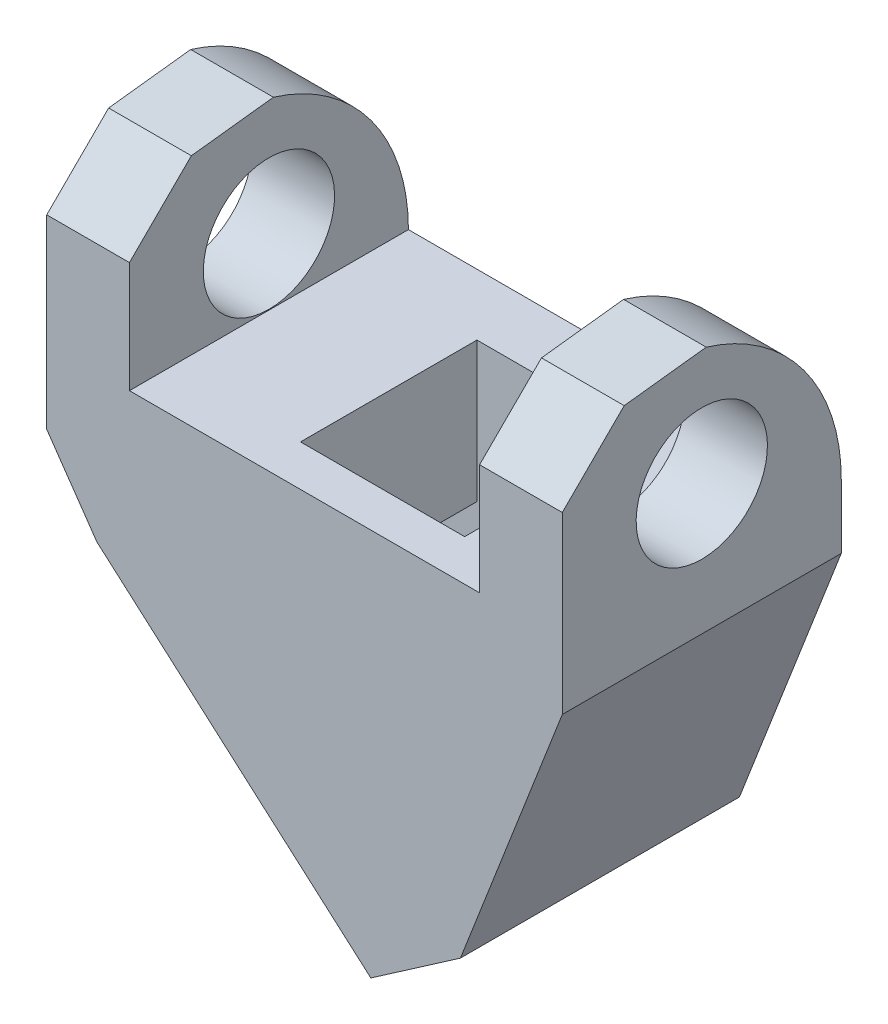
ISO-10303-21;
HEADER;
FILE_DESCRIPTION(('STEP AP214'),'2;1');
FILE_NAME('part.step','',(''),(''),'','','');
FILE_SCHEMA(('AUTOMOTIVE_DESIGN { 1 0 10303 214 1 1 1 1 }'));
ENDSEC;
DATA;
#1=APPLICATION_CONTEXT('core data for automotive mechanical design processes');
#2=APPLICATION_PROTOCOL_DEFINITION('international standard','automotive_design',2000,#1);
#3=PRODUCT_CONTEXT('',#1,'mechanical');
#4=PRODUCT('Part','Part','',(#3));
#5=PRODUCT_RELATED_PRODUCT_CATEGORY('part','',(#4));
#6=PRODUCT_DEFINITION_FORMATION('','',#4);
#7=PRODUCT_DEFINITION_CONTEXT('part definition',#1,'design');
#8=PRODUCT_DEFINITION('design','',#6,#7);
#9=PRODUCT_DEFINITION_SHAPE('','',#8);
#10=(LENGTH_UNIT() NAMED_UNIT(*) SI_UNIT(.MILLI.,.METRE.));
#11=(NAMED_UNIT(*) PLANE_ANGLE_UNIT() SI_UNIT($,.RADIAN.));
#12=(NAMED_UNIT(*) SI_UNIT($,.STERADIAN.) SOLID_ANGLE_UNIT());
#13=UNCERTAINTY_MEASURE_WITH_UNIT(LENGTH_MEASURE(1.E-05),#10,'distance_accuracy_value','');
#14=(GEOMETRIC_REPRESENTATION_CONTEXT(3) GLOBAL_UNCERTAINTY_ASSIGNED_CONTEXT((#13)) GLOBAL_UNIT_ASSIGNED_CONTEXT((#10,
#11,#12)) REPRESENTATION_CONTEXT('',''));
#15=CARTESIAN_POINT('',(0.,0.,0.));
#16=DIRECTION('',(0.,0.,1.));
#17=DIRECTION('',(1.,0.,0.));
#18=AXIS2_PLACEMENT_3D('',#15,#16,#17);
#19=CARTESIAN_POINT('',(-6.62620064692458,-23.6390631964154,17.));
#20=DIRECTION('',(0.660001667960941,0.751264133503508,0.));
#21=DIRECTION('',(-0.751264133503508,0.660001667960941,0.));
#22=AXIS2_PLACEMENT_3D('',#19,#20,#21);
#23=PLANE('',#22);
#24=DIRECTION('',(0.751264133503508,-0.660001667960941,0.));
#25=VECTOR('',#24,1.);
#26=CARTESIAN_POINT('',(-6.62620064692458,-23.6390631964154,0.));
#27=LINE('',#26,#25);
#28=CARTESIAN_POINT('',(-23.3192896933725,-8.97382613432327,0.));
#29=VERTEX_POINT('',#28);
#30=CARTESIAN_POINT('',(-6.62620064692458,-23.6390631964154,0.));
#31=VERTEX_POINT('',#30);
#32=EDGE_CURVE('E294',#29,#31,#27,.T.);
#33=ORIENTED_EDGE('',*,*,#32,.T.);
#34=DIRECTION('',(0.,0.,-1.));
#35=VECTOR('',#34,1.);
#36=CARTESIAN_POINT('',(-6.62620064692458,-23.6390631964154,17.));
#37=LINE('',#36,#35);
#38=CARTESIAN_POINT('',(-6.62620064692458,-23.6390631964154,17.));
#39=VERTEX_POINT('',#38);
#40=EDGE_CURVE('E310',#39,#31,#37,.T.);
#41=ORIENTED_EDGE('',*,*,#40,.F.);
#42=DIRECTION('',(0.751264133503508,-0.660001667960941,0.));
#43=VECTOR('',#42,1.);
#44=CARTESIAN_POINT('',(-6.62620064692458,-23.6390631964154,17.));
#45=LINE('',#44,#43);
#46=CARTESIAN_POINT('',(-23.3192896933725,-8.97382613432327,17.));
#47=VERTEX_POINT('',#46);
#48=EDGE_CURVE('E276',#47,#39,#45,.T.);
#49=ORIENTED_EDGE('',*,*,#48,.F.);
#50=DIRECTION('',(0.,0.,-1.));
#51=VECTOR('',#50,1.);
#52=CARTESIAN_POINT('',(-23.3192896933725,-8.97382613432327,17.));
#53=LINE('',#52,#51);
#54=EDGE_CURVE('E313',#47,#29,#53,.T.);
#55=ORIENTED_EDGE('',*,*,#54,.T.);
#56=EDGE_LOOP('',(#33,#41,#49,#55));
#57=FACE_BOUND('',#56,.T.);
#58=DIRECTION('',(-0.751264133503508,0.660001667960941,0.));
#59=VECTOR('',#58,1.);
#60=CARTESIAN_POINT('',(-19.1687805846796,-12.6201374813718,3.73999999999995));
#61=LINE('',#60,#59);
#62=CARTESIAN_POINT('',(-9.64628246360878,-20.9858564912123,3.73999999999995));
#63=VERTEX_POINT('',#62);
#64=CARTESIAN_POINT('',(-19.0145462083975,-12.7556356917394,3.73999999999995));
#65=VERTEX_POINT('',#64);
#66=EDGE_CURVE('E211',#63,#65,#61,.T.);
#67=ORIENTED_EDGE('',*,*,#66,.T.);
#68=DIRECTION('',(0.,0.,1.));
#69=VECTOR('',#68,1.);
#70=CARTESIAN_POINT('',(-19.0145462083975,-12.7556356917394,3.73999999999995));
#71=LINE('',#70,#69);
#72=CARTESIAN_POINT('',(-19.0145462083975,-12.7556356917394,14.4899999999999));
#73=VERTEX_POINT('',#72);
#74=EDGE_CURVE('E207',#65,#73,#71,.T.);
#75=ORIENTED_EDGE('',*,*,#74,.T.);
#76=DIRECTION('',(0.751264133503508,-0.660001667960941,0.));
#77=VECTOR('',#76,1.);
#78=CARTESIAN_POINT('',(-19.1687805846796,-12.6201374813718,14.4899999999999));
#79=LINE('',#78,#77);
#80=CARTESIAN_POINT('',(-9.64628246360878,-20.9858564912123,14.4899999999999));
#81=VERTEX_POINT('',#80);
#82=EDGE_CURVE('E210',#73,#81,#79,.T.);
#83=ORIENTED_EDGE('',*,*,#82,.T.);
#84=DIRECTION('',(0.,0.,-1.));
#85=VECTOR('',#84,1.);
#86=CARTESIAN_POINT('',(-9.64628246360878,-20.9858564912123,3.73999999999995));
#87=LINE('',#86,#85);
#88=EDGE_CURVE('E213',#81,#63,#87,.T.);
#89=ORIENTED_EDGE('',*,*,#88,.T.);
#90=EDGE_LOOP('',(#67,#75,#83,#89));
#91=FACE_BOUND('',#90,.T.);
#92=ADVANCED_FACE('F32',(#57,#91),#23,.F.);
#93=CARTESIAN_POINT('',(-21.3355501398711,11.1,17.));
#94=DIRECTION('',(-1.,0.,0.));
#95=DIRECTION('',(0.,-1.,0.));
#96=AXIS2_PLACEMENT_3D('',#93,#94,#95);
#97=PLANE('',#96);
#98=CARTESIAN_POINT('',(-21.3355501398711,4.04162085133609,8.5));
#99=DIRECTION('',(-1.,0.,0.));
#100=DIRECTION('',(0.,-1.,0.));
#101=AXIS2_PLACEMENT_3D('',#98,#99,#100);
#102=CIRCLE('',#101,4.);
#103=CARTESIAN_POINT('',(-21.3355501398711,0.0416208513360841,8.5));
#104=VERTEX_POINT('',#103);
#105=EDGE_CURVE('E436',#104,#104,#102,.T.);
#106=ORIENTED_EDGE('',*,*,#105,.T.);
#107=EDGE_LOOP('',(#106));
#108=FACE_BOUND('',#107,.T.);
#109=DIRECTION('',(0.,0.705253158861616,-0.708955557080775));
#110=VECTOR('',#109,1.);
#111=CARTESIAN_POINT('',(-21.3355501398711,8.91863795848581,14.8300297458231));
#112=LINE('',#111,#110);
#113=CARTESIAN_POINT('',(-21.3355501398711,6.76,17.));
#114=VERTEX_POINT('',#113);
#115=CARTESIAN_POINT('',(-21.3355501398711,10.5122475955982,13.2280540668032));
#116=VERTEX_POINT('',#115);
#117=EDGE_CURVE('E256',#114,#116,#112,.T.);
#118=ORIENTED_EDGE('',*,*,#117,.F.);
#119=DIRECTION('',(0.,1.,0.));
#120=VECTOR('',#119,1.);
#121=CARTESIAN_POINT('',(-21.3355501398711,11.1,17.));
#122=LINE('',#121,#120);
#123=CARTESIAN_POINT('',(-21.3355501398711,0.,17.));
#124=VERTEX_POINT('',#123);
#125=EDGE_CURVE('E268',#124,#114,#122,.T.);
#126=ORIENTED_EDGE('',*,*,#125,.F.);
#127=DIRECTION('',(0.,0.,-1.));
#128=VECTOR('',#127,1.);
#129=CARTESIAN_POINT('',(-21.3355501398711,0.,17.));
#130=LINE('',#129,#128);
#131=CARTESIAN_POINT('',(-21.3355501398711,0.,0.));
#132=VERTEX_POINT('',#131);
#133=EDGE_CURVE('E319',#124,#132,#130,.T.);
#134=ORIENTED_EDGE('',*,*,#133,.T.);
#135=CARTESIAN_POINT('',(-21.3355501398711,0.,11.6012165316514));
#136=DIRECTION('',(-1.,0.,0.));
#137=DIRECTION('',(0.,-1.,0.));
#138=AXIS2_PLACEMENT_3D('',#135,#136,#137);
#139=CIRCLE('',#138,11.6012165316514);
#140=CARTESIAN_POINT('',(-21.3355501398711,11.1,8.22805406680315));
#141=VERTEX_POINT('',#140);
#142=EDGE_CURVE('E248',#141,#132,#139,.T.);
#143=ORIENTED_EDGE('',*,*,#142,.F.);
#144=DIRECTION('',(0.,0.116746638974287,-0.993161730177018));
#145=VECTOR('',#144,1.);
#146=CARTESIAN_POINT('',(-21.3355501398711,10.0829078343711,16.8804403268307));
#147=LINE('',#146,#145);
#148=EDGE_CURVE('E262',#116,#141,#147,.T.);
#149=ORIENTED_EDGE('',*,*,#148,.F.);
#150=EDGE_LOOP('',(#118,#126,#134,#143,#149));
#151=FACE_BOUND('',#150,.T.);
#152=ADVANCED_FACE('F357',(#108,#151),#97,.F.);
#153=CARTESIAN_POINT('',(-26.3755501398711,-4.55837914866391,17.));
#154=DIRECTION('',(1.,0.,0.));
#155=DIRECTION('',(0.,0.,-1.));
#156=AXIS2_PLACEMENT_3D('',#153,#154,#155);
#157=PLANE('',#156);
#158=CARTESIAN_POINT('',(-26.3755501398711,4.04162085133609,8.5));
#159=DIRECTION('',(1.,0.,0.));
#160=DIRECTION('',(0.,0.,-1.));
#161=AXIS2_PLACEMENT_3D('',#158,#159,#160);
#162=CIRCLE('',#161,4.);
#163=CARTESIAN_POINT('',(-26.3755501398711,4.04162085133609,4.5));
#164=VERTEX_POINT('',#163);
#165=EDGE_CURVE('E434',#164,#164,#162,.T.);
#166=ORIENTED_EDGE('',*,*,#165,.T.);
#167=EDGE_LOOP('',(#166));
#168=FACE_BOUND('',#167,.T.);
#169=DIRECTION('',(0.,-0.705253158861616,0.708955557080775));
#170=VECTOR('',#169,1.);
#171=CARTESIAN_POINT('',(-26.3755501398711,1.13044173759442,22.6591119995615));
#172=LINE('',#171,#170);
#173=CARTESIAN_POINT('',(-26.3755501398711,10.5122475955982,13.2280540668032));
#174=VERTEX_POINT('',#173);
#175=CARTESIAN_POINT('',(-26.3755501398711,6.76,17.));
#176=VERTEX_POINT('',#175);
#177=EDGE_CURVE('E254',#174,#176,#172,.T.);
#178=ORIENTED_EDGE('',*,*,#177,.F.);
#179=DIRECTION('',(0.,-0.116746638974287,0.993161730177018));
#180=VECTOR('',#179,1.);
#181=CARTESIAN_POINT('',(-26.3755501398711,9.86948760724782,18.6960026752353));
#182=LINE('',#181,#180);
#183=CARTESIAN_POINT('',(-26.3755501398711,11.1,8.22805406680315));
#184=VERTEX_POINT('',#183);
#185=EDGE_CURVE('E260',#184,#174,#182,.T.);
#186=ORIENTED_EDGE('',*,*,#185,.F.);
#187=CARTESIAN_POINT('',(-26.3755501398711,0.,11.6012165316514));
#188=DIRECTION('',(1.,0.,0.));
#189=DIRECTION('',(0.,0.,-1.));
#190=AXIS2_PLACEMENT_3D('',#187,#188,#189);
#191=CIRCLE('',#190,11.6012165316514);
#192=CARTESIAN_POINT('',(-26.3755501398711,0.,0.));
#193=VERTEX_POINT('',#192);
#194=EDGE_CURVE('E246',#193,#184,#191,.T.);
#195=ORIENTED_EDGE('',*,*,#194,.F.);
#196=DIRECTION('',(0.,-1.,0.));
#197=VECTOR('',#196,1.);
#198=CARTESIAN_POINT('',(-26.3755501398711,-4.55837914866391,0.));
#199=LINE('',#198,#197);
#200=CARTESIAN_POINT('',(-26.3755501398711,-4.55837914866391,0.));
#201=VERTEX_POINT('',#200);
#202=EDGE_CURVE('E290',#193,#201,#199,.T.);
#203=ORIENTED_EDGE('',*,*,#202,.T.);
#204=DIRECTION('',(0.,0.,-1.));
#205=VECTOR('',#204,1.);
#206=CARTESIAN_POINT('',(-26.3755501398711,-4.55837914866391,17.));
#207=LINE('',#206,#205);
#208=CARTESIAN_POINT('',(-26.3755501398711,-4.55837914866391,17.));
#209=VERTEX_POINT('',#208);
#210=EDGE_CURVE('E316',#209,#201,#207,.T.);
#211=ORIENTED_EDGE('',*,*,#210,.F.);
#212=DIRECTION('',(0.,-1.,0.));
#213=VECTOR('',#212,1.);
#214=CARTESIAN_POINT('',(-26.3755501398711,-4.55837914866391,17.));
#215=LINE('',#214,#213);
#216=EDGE_CURVE('E272',#176,#209,#215,.T.);
#217=ORIENTED_EDGE('',*,*,#216,.F.);
#218=EDGE_LOOP('',(#178,#186,#195,#203,#211,#217));
#219=FACE_BOUND('',#218,.T.);
#220=ADVANCED_FACE('F393',(#168,#219),#157,.F.);
#221=CARTESIAN_POINT('',(5.04,11.1,17.));
#222=DIRECTION('',(-1.,0.,0.));
#223=DIRECTION('',(0.,-1.,0.));
#224=AXIS2_PLACEMENT_3D('',#221,#222,#223);
#225=PLANE('',#224);
#226=CARTESIAN_POINT('',(5.04,4.04162085133608,8.5));
#227=DIRECTION('',(-1.,0.,0.));
#228=DIRECTION('',(0.,-1.,0.));
#229=AXIS2_PLACEMENT_3D('',#226,#227,#228);
#230=CIRCLE('',#229,4.);
#231=CARTESIAN_POINT('',(5.04,0.0416208513360763,8.5));
#232=VERTEX_POINT('',#231);
#233=EDGE_CURVE('E437',#232,#232,#230,.T.);
#234=ORIENTED_EDGE('',*,*,#233,.T.);
#235=EDGE_LOOP('',(#234));
#236=FACE_BOUND('',#235,.T.);
#237=DIRECTION('',(0.,0.705253158861616,-0.708955557080775));
#238=VECTOR('',#237,1.);
#239=CARTESIAN_POINT('',(5.04,8.91863795848581,14.8300297458231));
#240=LINE('',#239,#238);
#241=CARTESIAN_POINT('',(5.04,6.76,17.));
#242=VERTEX_POINT('',#241);
#243=CARTESIAN_POINT('',(5.04,10.5122475955982,13.2280540668032));
#244=VERTEX_POINT('',#243);
#245=EDGE_CURVE('E252',#242,#244,#240,.T.);
#246=ORIENTED_EDGE('',*,*,#245,.F.);
#247=DIRECTION('',(0.,1.,0.));
#248=VECTOR('',#247,1.);
#249=CARTESIAN_POINT('',(5.04,11.1,17.));
#250=LINE('',#249,#248);
#251=CARTESIAN_POINT('',(5.04,-3.9,17.));
#252=VERTEX_POINT('',#251);
#253=EDGE_CURVE('E282',#252,#242,#250,.T.);
#254=ORIENTED_EDGE('',*,*,#253,.F.);
#255=DIRECTION('',(0.,0.,-1.));
#256=VECTOR('',#255,1.);
#257=CARTESIAN_POINT('',(5.04,-3.9,17.));
#258=LINE('',#257,#256);
#259=CARTESIAN_POINT('',(5.04,-3.9,0.));
#260=VERTEX_POINT('',#259);
#261=EDGE_CURVE('E304',#252,#260,#258,.T.);
#262=ORIENTED_EDGE('',*,*,#261,.T.);
#263=DIRECTION('',(0.,1.,0.));
#264=VECTOR('',#263,1.);
#265=CARTESIAN_POINT('',(5.04,11.1,0.));
#266=LINE('',#265,#264);
#267=CARTESIAN_POINT('',(5.04,0.,0.));
#268=VERTEX_POINT('',#267);
#269=EDGE_CURVE('E269',#260,#268,#266,.T.);
#270=ORIENTED_EDGE('',*,*,#269,.T.);
#271=CARTESIAN_POINT('',(5.04,0.,11.6012165316514));
#272=DIRECTION('',(-1.,0.,0.));
#273=DIRECTION('',(0.,-1.,0.));
#274=AXIS2_PLACEMENT_3D('',#271,#272,#273);
#275=CIRCLE('',#274,11.6012165316514);
#276=CARTESIAN_POINT('',(5.04,11.1,8.22805406680315));
#277=VERTEX_POINT('',#276);
#278=EDGE_CURVE('E244',#277,#268,#275,.T.);
#279=ORIENTED_EDGE('',*,*,#278,.F.);
#280=DIRECTION('',(0.,0.116746638974287,-0.993161730177018));
#281=VECTOR('',#280,1.);
#282=CARTESIAN_POINT('',(5.04,10.0829078343711,16.8804403268307));
#283=LINE('',#282,#281);
#284=EDGE_CURVE('E258',#244,#277,#283,.T.);
#285=ORIENTED_EDGE('',*,*,#284,.F.);
#286=EDGE_LOOP('',(#246,#254,#262,#270,#279,#285));
#287=FACE_BOUND('',#286,.T.);
#288=ADVANCED_FACE('F369',(#236,#287),#225,.F.);
#289=CARTESIAN_POINT('',(0.,0.,17.));
#290=DIRECTION('',(1.,0.,0.));
#291=DIRECTION('',(0.,0.,-1.));
#292=AXIS2_PLACEMENT_3D('',#289,#290,#291);
#293=PLANE('',#292);
#294=CARTESIAN_POINT('',(0.,4.04162085133608,8.5));
#295=DIRECTION('',(1.,0.,0.));
#296=DIRECTION('',(0.,0.,-1.));
#297=AXIS2_PLACEMENT_3D('',#294,#295,#296);
#298=CIRCLE('',#297,4.);
#299=CARTESIAN_POINT('',(0.,4.04162085133608,4.5));
#300=VERTEX_POINT('',#299);
#301=EDGE_CURVE('E36',#300,#300,#298,.T.);
#302=ORIENTED_EDGE('',*,*,#301,.T.);
#303=EDGE_LOOP('',(#302));
#304=FACE_BOUND('',#303,.T.);
#305=DIRECTION('',(0.,-0.705253158861616,0.708955557080775));
#306=VECTOR('',#305,1.);
#307=CARTESIAN_POINT('',(0.,3.39769755775021,20.3799536677963));
#308=LINE('',#307,#306);
#309=CARTESIAN_POINT('',(0.,10.5122475955982,13.2280540668032));
#310=VERTEX_POINT('',#309);
#311=CARTESIAN_POINT('',(0.,6.76,17.));
#312=VERTEX_POINT('',#311);
#313=EDGE_CURVE('E250',#310,#312,#308,.T.);
#314=ORIENTED_EDGE('',*,*,#313,.F.);
#315=DIRECTION('',(0.,-0.116746638974287,0.993161730177018));
#316=VECTOR('',#315,1.);
#317=CARTESIAN_POINT('',(0.,9.93161730177018,18.1674663897429));
#318=LINE('',#317,#316);
#319=CARTESIAN_POINT('',(0.,11.1,8.22805406680315));
#320=VERTEX_POINT('',#319);
#321=EDGE_CURVE('E11',#320,#310,#318,.T.);
#322=ORIENTED_EDGE('',*,*,#321,.F.);
#323=CARTESIAN_POINT('',(0.,0.,11.6012165316514));
#324=DIRECTION('',(1.,0.,0.));
#325=DIRECTION('',(0.,0.,-1.));
#326=AXIS2_PLACEMENT_3D('',#323,#324,#325);
#327=CIRCLE('',#326,11.6012165316514);
#328=CARTESIAN_POINT('',(0.,0.,0.));
#329=VERTEX_POINT('',#328);
#330=EDGE_CURVE('E242',#329,#320,#327,.T.);
#331=ORIENTED_EDGE('',*,*,#330,.F.);
#332=DIRECTION('',(0.,0.,-1.));
#333=VECTOR('',#332,1.);
#334=CARTESIAN_POINT('',(0.,0.,17.));
#335=LINE('',#334,#333);
#336=CARTESIAN_POINT('',(0.,0.,17.));
#337=VERTEX_POINT('',#336);
#338=EDGE_CURVE('E287',#337,#329,#335,.T.);
#339=ORIENTED_EDGE('',*,*,#338,.F.);
#340=DIRECTION('',(0.,-1.,0.));
#341=VECTOR('',#340,1.);
#342=CARTESIAN_POINT('',(0.,0.,17.));
#343=LINE('',#342,#341);
#344=EDGE_CURVE('E285',#312,#337,#343,.T.);
#345=ORIENTED_EDGE('',*,*,#344,.F.);
#346=EDGE_LOOP('',(#314,#322,#331,#339,#345));
#347=FACE_BOUND('',#346,.T.);
#348=ADVANCED_FACE('F344',(#304,#347),#293,.F.);
#349=CARTESIAN_POINT('',(0.,0.,17.));
#350=DIRECTION('',(0.,0.,1.));
#351=DIRECTION('',(1.,0.,0.));
#352=AXIS2_PLACEMENT_3D('',#349,#350,#351);
#353=PLANE('',#352);
#354=ORIENTED_EDGE('',*,*,#253,.T.);
#355=DIRECTION('',(-1.,0.,0.));
#356=VECTOR('',#355,1.);
#357=CARTESIAN_POINT('',(0.,6.76,17.));
#358=LINE('',#357,#356);
#359=EDGE_CURVE('E41',#242,#312,#358,.T.);
#360=ORIENTED_EDGE('',*,*,#359,.T.);
#361=ORIENTED_EDGE('',*,*,#344,.T.);
#362=DIRECTION('',(-1.,0.,0.));
#363=VECTOR('',#362,1.);
#364=CARTESIAN_POINT('',(-21.3355501398711,0.,17.));
#365=LINE('',#364,#363);
#366=EDGE_CURVE('E265',#337,#124,#365,.T.);
#367=ORIENTED_EDGE('',*,*,#366,.T.);
#368=ORIENTED_EDGE('',*,*,#125,.T.);
#369=EDGE_CURVE('E325',#114,#176,#358,.T.);
#370=ORIENTED_EDGE('',*,*,#369,.T.);
#371=ORIENTED_EDGE('',*,*,#216,.T.);
#372=DIRECTION('',(0.569136023556532,-0.822243386528744,0.));
#373=VECTOR('',#372,1.);
#374=CARTESIAN_POINT('',(-23.3192896933725,-8.97382613432327,17.));
#375=LINE('',#374,#373);
#376=EDGE_CURVE('E274',#209,#47,#375,.T.);
#377=ORIENTED_EDGE('',*,*,#376,.T.);
#378=ORIENTED_EDGE('',*,*,#48,.T.);
#379=DIRECTION('',(0.822243386528745,0.569136023556532,0.));
#380=VECTOR('',#379,1.);
#381=CARTESIAN_POINT('',(-1.16650456037372,-19.86,17.));
#382=LINE('',#381,#380);
#383=CARTESIAN_POINT('',(-1.16650456037372,-19.86,17.));
#384=VERTEX_POINT('',#383);
#385=EDGE_CURVE('E278',#39,#384,#382,.T.);
#386=ORIENTED_EDGE('',*,*,#385,.T.);
#387=DIRECTION('',(0.362438038283702,0.932007869282798,0.));
#388=VECTOR('',#387,1.);
#389=CARTESIAN_POINT('',(5.04,-3.9,17.));
#390=LINE('',#389,#388);
#391=EDGE_CURVE('E280',#384,#252,#390,.T.);
#392=ORIENTED_EDGE('',*,*,#391,.T.);
#393=EDGE_LOOP('',(#354,#360,#361,#367,#368,#370,#371,#377,#378,#386,#392));
#394=FACE_BOUND('',#393,.T.);
#395=ADVANCED_FACE('F359',(#394),#353,.T.);
#396=CARTESIAN_POINT('',(0.,0.,0.));
#397=DIRECTION('',(0.,0.,1.));
#398=DIRECTION('',(1.,0.,0.));
#399=AXIS2_PLACEMENT_3D('',#396,#397,#398);
#400=PLANE('',#399);
#401=DIRECTION('',(-1.,0.,0.));
#402=VECTOR('',#401,1.);
#403=CARTESIAN_POINT('',(31.,0.,0.));
#404=LINE('',#403,#402);
#405=EDGE_CURVE('E324',#268,#329,#404,.T.);
#406=ORIENTED_EDGE('',*,*,#405,.F.);
#407=ORIENTED_EDGE('',*,*,#269,.F.);
#408=DIRECTION('',(0.362438038283702,0.932007869282798,0.));
#409=VECTOR('',#408,1.);
#410=CARTESIAN_POINT('',(5.04,-3.9,0.));
#411=LINE('',#410,#409);
#412=CARTESIAN_POINT('',(-1.16650456037372,-19.86,0.));
#413=VERTEX_POINT('',#412);
#414=EDGE_CURVE('E298',#413,#260,#411,.T.);
#415=ORIENTED_EDGE('',*,*,#414,.F.);
#416=DIRECTION('',(0.822243386528745,0.569136023556532,0.));
#417=VECTOR('',#416,1.);
#418=CARTESIAN_POINT('',(-1.16650456037372,-19.86,0.));
#419=LINE('',#418,#417);
#420=EDGE_CURVE('E296',#31,#413,#419,.T.);
#421=ORIENTED_EDGE('',*,*,#420,.F.);
#422=ORIENTED_EDGE('',*,*,#32,.F.);
#423=DIRECTION('',(0.569136023556532,-0.822243386528744,0.));
#424=VECTOR('',#423,1.);
#425=CARTESIAN_POINT('',(-23.3192896933725,-8.97382613432327,0.));
#426=LINE('',#425,#424);
#427=EDGE_CURVE('E292',#201,#29,#426,.T.);
#428=ORIENTED_EDGE('',*,*,#427,.F.);
#429=ORIENTED_EDGE('',*,*,#202,.F.);
#430=EDGE_CURVE('E322',#132,#193,#404,.T.);
#431=ORIENTED_EDGE('',*,*,#430,.F.);
#432=DIRECTION('',(-1.,0.,0.));
#433=VECTOR('',#432,1.);
#434=CARTESIAN_POINT('',(-21.3355501398711,0.,0.));
#435=LINE('',#434,#433);
#436=EDGE_CURVE('E264',#329,#132,#435,.T.);
#437=ORIENTED_EDGE('',*,*,#436,.F.);
#438=EDGE_LOOP('',(#406,#407,#415,#421,#422,#428,#429,#431,#437));
#439=FACE_BOUND('',#438,.T.);
#440=ADVANCED_FACE('F349',(#439),#400,.F.);
#441=CARTESIAN_POINT('',(-21.3355501398711,0.,17.));
#442=DIRECTION('',(0.,-1.,0.));
#443=DIRECTION('',(0.,0.,-1.));
#444=AXIS2_PLACEMENT_3D('',#441,#442,#443);
#445=PLANE('',#444);
#446=DIRECTION('',(-1.,0.,0.));
#447=VECTOR('',#446,1.);
#448=CARTESIAN_POINT('',(-3.42,0.,3.74));
#449=LINE('',#448,#447);
#450=CARTESIAN_POINT('',(-3.42,0.,3.74));
#451=VERTEX_POINT('',#450);
#452=CARTESIAN_POINT('',(-13.42,0.,3.74));
#453=VERTEX_POINT('',#452);
#454=EDGE_CURVE('E186',#451,#453,#449,.T.);
#455=ORIENTED_EDGE('',*,*,#454,.F.);
#456=DIRECTION('',(0.,0.,-1.));
#457=VECTOR('',#456,1.);
#458=CARTESIAN_POINT('',(-3.42,0.,14.49));
#459=LINE('',#458,#457);
#460=CARTESIAN_POINT('',(-3.42,0.,14.49));
#461=VERTEX_POINT('',#460);
#462=EDGE_CURVE('E48',#461,#451,#459,.T.);
#463=ORIENTED_EDGE('',*,*,#462,.F.);
#464=DIRECTION('',(1.,0.,0.));
#465=VECTOR('',#464,1.);
#466=CARTESIAN_POINT('',(-3.42,0.,14.49));
#467=LINE('',#466,#465);
#468=CARTESIAN_POINT('',(-13.42,0.,14.49));
#469=VERTEX_POINT('',#468);
#470=EDGE_CURVE('E193',#469,#461,#467,.T.);
#471=ORIENTED_EDGE('',*,*,#470,.F.);
#472=DIRECTION('',(0.,0.,1.));
#473=VECTOR('',#472,1.);
#474=CARTESIAN_POINT('',(-13.42,0.,14.49));
#475=LINE('',#474,#473);
#476=EDGE_CURVE('E177',#453,#469,#475,.T.);
#477=ORIENTED_EDGE('',*,*,#476,.F.);
#478=EDGE_LOOP('',(#455,#463,#471,#477));
#479=FACE_BOUND('',#478,.T.);
#480=ORIENTED_EDGE('',*,*,#436,.T.);
#481=ORIENTED_EDGE('',*,*,#133,.F.);
#482=ORIENTED_EDGE('',*,*,#366,.F.);
#483=ORIENTED_EDGE('',*,*,#338,.T.);
#484=EDGE_LOOP('',(#480,#481,#482,#483));
#485=FACE_BOUND('',#484,.T.);
#486=ADVANCED_FACE('F34',(#479,#485),#445,.F.);
#487=CARTESIAN_POINT('',(-23.3192896933725,-8.97382613432327,17.));
#488=DIRECTION('',(0.822243386528744,0.569136023556532,0.));
#489=DIRECTION('',(-0.569136023556532,0.822243386528744,0.));
#490=AXIS2_PLACEMENT_3D('',#487,#488,#489);
#491=PLANE('',#490);
#492=ORIENTED_EDGE('',*,*,#427,.T.);
#493=ORIENTED_EDGE('',*,*,#54,.F.);
#494=ORIENTED_EDGE('',*,*,#376,.F.);
#495=ORIENTED_EDGE('',*,*,#210,.T.);
#496=EDGE_LOOP('',(#492,#493,#494,#495));
#497=FACE_BOUND('',#496,.T.);
#498=ADVANCED_FACE('F388',(#497),#491,.F.);
#499=CARTESIAN_POINT('',(-1.16650456037372,-19.86,17.));
#500=DIRECTION('',(-0.569136023556532,0.822243386528745,0.));
#501=DIRECTION('',(-0.822243386528745,-0.569136023556532,0.));
#502=AXIS2_PLACEMENT_3D('',#499,#500,#501);
#503=PLANE('',#502);
#504=ORIENTED_EDGE('',*,*,#420,.T.);
#505=DIRECTION('',(0.,0.,-1.));
#506=VECTOR('',#505,1.);
#507=CARTESIAN_POINT('',(-1.16650456037372,-19.86,17.));
#508=LINE('',#507,#506);
#509=EDGE_CURVE('E307',#384,#413,#508,.T.);
#510=ORIENTED_EDGE('',*,*,#509,.F.);
#511=ORIENTED_EDGE('',*,*,#385,.F.);
#512=ORIENTED_EDGE('',*,*,#40,.T.);
#513=EDGE_LOOP('',(#504,#510,#511,#512));
#514=FACE_BOUND('',#513,.T.);
#515=ADVANCED_FACE('F381',(#514),#503,.F.);
#516=CARTESIAN_POINT('',(5.04,-3.9,17.));
#517=DIRECTION('',(-0.932007869282799,0.362438038283702,0.));
#518=DIRECTION('',(-0.362438038283702,-0.932007869282798,0.));
#519=AXIS2_PLACEMENT_3D('',#516,#517,#518);
#520=PLANE('',#519);
#521=ORIENTED_EDGE('',*,*,#414,.T.);
#522=ORIENTED_EDGE('',*,*,#261,.F.);
#523=ORIENTED_EDGE('',*,*,#391,.F.);
#524=ORIENTED_EDGE('',*,*,#509,.T.);
#525=EDGE_LOOP('',(#521,#522,#523,#524));
#526=FACE_BOUND('',#525,.T.);
#527=ADVANCED_FACE('F376',(#526),#520,.F.);
#528=CARTESIAN_POINT('',(31.,0.,11.6012165316514));
#529=DIRECTION('',(-1.,0.,0.));
#530=DIRECTION('',(0.,-1.,0.));
#531=AXIS2_PLACEMENT_3D('',#528,#529,#530);
#532=CYLINDRICAL_SURFACE('',#531,11.6012165316514);
#533=ORIENTED_EDGE('',*,*,#142,.T.);
#534=ORIENTED_EDGE('',*,*,#430,.T.);
#535=ORIENTED_EDGE('',*,*,#194,.T.);
#536=DIRECTION('',(-1.,0.,0.));
#537=VECTOR('',#536,1.);
#538=CARTESIAN_POINT('',(31.,11.1,8.22805406680315));
#539=LINE('',#538,#537);
#540=EDGE_CURVE('E216',#141,#184,#539,.T.);
#541=ORIENTED_EDGE('',*,*,#540,.F.);
#542=EDGE_LOOP('',(#533,#534,#535,#541));
#543=FACE_BOUND('',#542,.T.);
#544=ADVANCED_FACE('F396',(#543),#532,.T.);
#545=CARTESIAN_POINT('',(31.,11.8975810418533,11.8354479752292));
#546=DIRECTION('',(0.,0.708955557080775,0.705253158861616));
#547=DIRECTION('',(0.,-0.705253158861616,0.708955557080775));
#548=AXIS2_PLACEMENT_3D('',#545,#546,#547);
#549=PLANE('',#548);
#550=ORIENTED_EDGE('',*,*,#117,.T.);
#551=DIRECTION('',(-1.,0.,0.));
#552=VECTOR('',#551,1.);
#553=CARTESIAN_POINT('',(31.,10.5122475955982,13.2280540668032));
#554=LINE('',#553,#552);
#555=EDGE_CURVE('E235',#116,#174,#554,.T.);
#556=ORIENTED_EDGE('',*,*,#555,.T.);
#557=ORIENTED_EDGE('',*,*,#177,.T.);
#558=ORIENTED_EDGE('',*,*,#369,.F.);
#559=EDGE_LOOP('',(#550,#556,#557,#558));
#560=FACE_BOUND('',#559,.T.);
#561=ADVANCED_FACE('F401',(#560),#549,.T.);
#562=CARTESIAN_POINT('',(31.,11.9027382990231,1.39917261084334));
#563=DIRECTION('',(0.,0.993161730177018,0.116746638974287));
#564=DIRECTION('',(0.,-0.116746638974287,0.993161730177018));
#565=AXIS2_PLACEMENT_3D('',#562,#563,#564);
#566=PLANE('',#565);
#567=ORIENTED_EDGE('',*,*,#148,.T.);
#568=ORIENTED_EDGE('',*,*,#540,.T.);
#569=ORIENTED_EDGE('',*,*,#185,.T.);
#570=ORIENTED_EDGE('',*,*,#555,.F.);
#571=EDGE_LOOP('',(#567,#568,#569,#570));
#572=FACE_BOUND('',#571,.T.);
#573=ADVANCED_FACE('F398',(#572),#566,.T.);
#574=ORIENTED_EDGE('',*,*,#284,.T.);
#575=EDGE_CURVE('E239',#277,#320,#539,.T.);
#576=ORIENTED_EDGE('',*,*,#575,.T.);
#577=ORIENTED_EDGE('',*,*,#321,.T.);
#578=EDGE_CURVE('E238',#244,#310,#554,.T.);
#579=ORIENTED_EDGE('',*,*,#578,.F.);
#580=EDGE_LOOP('',(#574,#576,#577,#579));
#581=FACE_BOUND('',#580,.T.);
#582=ADVANCED_FACE('F367',(#581),#566,.T.);
#583=ORIENTED_EDGE('',*,*,#245,.T.);
#584=ORIENTED_EDGE('',*,*,#578,.T.);
#585=ORIENTED_EDGE('',*,*,#313,.T.);
#586=ORIENTED_EDGE('',*,*,#359,.F.);
#587=EDGE_LOOP('',(#583,#584,#585,#586));
#588=FACE_BOUND('',#587,.T.);
#589=ADVANCED_FACE('F362',(#588),#549,.T.);
#590=ORIENTED_EDGE('',*,*,#278,.T.);
#591=ORIENTED_EDGE('',*,*,#405,.T.);
#592=ORIENTED_EDGE('',*,*,#330,.T.);
#593=ORIENTED_EDGE('',*,*,#575,.F.);
#594=EDGE_LOOP('',(#590,#591,#592,#593));
#595=FACE_BOUND('',#594,.T.);
#596=ADVANCED_FACE('F333',(#595),#532,.T.);
#597=CARTESIAN_POINT('',(-7.30160744156,-11.1019561027789,0.));
#598=DIRECTION('',(0.660001667960941,0.751264133503508,0.));
#599=DIRECTION('',(-0.751264133503507,0.660001667960941,0.));
#600=AXIS2_PLACEMENT_3D('',#597,#598,#599);
#601=PLANE('',#600);
#602=DIRECTION('',(-0.751264133503507,0.660001667960941,0.));
#603=VECTOR('',#602,1.);
#604=CARTESIAN_POINT('',(-11.7086774203584,-7.23025052399265,14.4899999999999));
#605=LINE('',#604,#603);
#606=CARTESIAN_POINT('',(-2.3404136755697,-15.4604713234656,14.4899999999999));
#607=VERTEX_POINT('',#606);
#608=CARTESIAN_POINT('',(-3.42,-14.5120315629928,14.49));
#609=VERTEX_POINT('',#608);
#610=EDGE_CURVE('E220',#607,#609,#605,.T.);
#611=ORIENTED_EDGE('',*,*,#610,.T.);
#612=DIRECTION('',(0.,0.,-1.));
#613=VECTOR('',#612,1.);
#614=CARTESIAN_POINT('',(-3.42,-14.5120315629928,0.));
#615=LINE('',#614,#613);
#616=CARTESIAN_POINT('',(-3.42,-14.5120315629928,3.74));
#617=VERTEX_POINT('',#616);
#618=EDGE_CURVE('E200',#609,#617,#615,.T.);
#619=ORIENTED_EDGE('',*,*,#618,.T.);
#620=DIRECTION('',(0.751264133503507,-0.660001667960941,0.));
#621=VECTOR('',#620,1.);
#622=CARTESIAN_POINT('',(-11.7086774203584,-7.23025052399265,3.73999999999995));
#623=LINE('',#622,#621);
#624=CARTESIAN_POINT('',(-2.3404136755697,-15.4604713234656,3.73999999999995));
#625=VERTEX_POINT('',#624);
#626=EDGE_CURVE('E228',#617,#625,#623,.T.);
#627=ORIENTED_EDGE('',*,*,#626,.T.);
#628=DIRECTION('',(0.,0.,1.));
#629=VECTOR('',#628,1.);
#630=CARTESIAN_POINT('',(-2.34041367556969,-15.4604713234656,3.73999999999995));
#631=LINE('',#630,#629);
#632=EDGE_CURVE('E217',#625,#607,#631,.T.);
#633=ORIENTED_EDGE('',*,*,#632,.T.);
#634=EDGE_LOOP('',(#611,#619,#627,#633));
#635=FACE_BOUND('',#634,.T.);
#636=ADVANCED_FACE('F475',(#635),#601,.F.);
#637=CARTESIAN_POINT('',(-19.8288763947251,-13.3715087745614,3.73999999999995));
#638=DIRECTION('',(0.,0.,1.));
#639=DIRECTION('',(0.,-1.,0.));
#640=AXIS2_PLACEMENT_3D('',#637,#638,#639);
#641=PLANE('',#640);
#642=ORIENTED_EDGE('',*,*,#626,.F.);
#643=DIRECTION('',(0.,1.,0.));
#644=VECTOR('',#643,1.);
#645=CARTESIAN_POINT('',(-3.42,-36.6035261952487,3.74));
#646=LINE('',#645,#644);
#647=EDGE_CURVE('E183',#617,#451,#646,.T.);
#648=ORIENTED_EDGE('',*,*,#647,.T.);
#649=ORIENTED_EDGE('',*,*,#454,.T.);
#650=DIRECTION('',(0.,1.,0.));
#651=VECTOR('',#650,1.);
#652=CARTESIAN_POINT('',(-13.42,-36.6035261952487,3.74));
#653=LINE('',#652,#651);
#654=CARTESIAN_POINT('',(-13.42,-8.5245136257694,3.73999999999995));
#655=VERTEX_POINT('',#654);
#656=EDGE_CURVE('E56',#655,#453,#653,.T.);
#657=ORIENTED_EDGE('',*,*,#656,.F.);
#658=DIRECTION('',(0.79758392882523,0.603207987745281,0.));
#659=VECTOR('',#658,1.);
#660=CARTESIAN_POINT('',(-19.8288763947251,-13.3715087745614,3.73999999999995));
#661=LINE('',#660,#659);
#662=EDGE_CURVE('E221',#65,#655,#661,.T.);
#663=ORIENTED_EDGE('',*,*,#662,.F.);
#664=ORIENTED_EDGE('',*,*,#66,.F.);
#665=DIRECTION('',(0.79758392882523,0.603207987745281,0.));
#666=VECTOR('',#665,1.);
#667=CARTESIAN_POINT('',(-10.4606126499363,-21.6017295740343,3.73999999999995));
#668=LINE('',#667,#666);
#669=EDGE_CURVE('E206',#63,#625,#668,.T.);
#670=ORIENTED_EDGE('',*,*,#669,.T.);
#671=EDGE_LOOP('',(#642,#648,#649,#657,#663,#664,#670));
#672=FACE_BOUND('',#671,.T.);
#673=ADVANCED_FACE('F188',(#672),#641,.T.);
#674=CARTESIAN_POINT('',(-19.8288763947251,-13.3715087745614,3.73999999999995));
#675=DIRECTION('',(0.603207987745281,-0.79758392882523,0.));
#676=DIRECTION('',(0.79758392882523,0.603207987745281,0.));
#677=AXIS2_PLACEMENT_3D('',#674,#675,#676);
#678=PLANE('',#677);
#679=DIRECTION('',(0.,0.,-1.));
#680=VECTOR('',#679,1.);
#681=CARTESIAN_POINT('',(-13.42,-8.5245136257694,3.73999999999994));
#682=LINE('',#681,#680);
#683=CARTESIAN_POINT('',(-13.42,-8.5245136257694,14.49));
#684=VERTEX_POINT('',#683);
#685=EDGE_CURVE('E180',#684,#655,#682,.T.);
#686=ORIENTED_EDGE('',*,*,#685,.F.);
#687=DIRECTION('',(0.79758392882523,0.603207987745281,0.));
#688=VECTOR('',#687,1.);
#689=CARTESIAN_POINT('',(-19.8288763947251,-13.3715087745614,14.4899999999999));
#690=LINE('',#689,#688);
#691=EDGE_CURVE('E224',#73,#684,#690,.T.);
#692=ORIENTED_EDGE('',*,*,#691,.F.);
#693=ORIENTED_EDGE('',*,*,#74,.F.);
#694=ORIENTED_EDGE('',*,*,#662,.T.);
#695=EDGE_LOOP('',(#686,#692,#693,#694));
#696=FACE_BOUND('',#695,.T.);
#697=ADVANCED_FACE('F469',(#696),#678,.T.);
#698=CARTESIAN_POINT('',(-19.8288763947251,-13.3715087745614,14.4899999999999));
#699=DIRECTION('',(0.,0.,-1.));
#700=DIRECTION('',(-1.,0.,0.));
#701=AXIS2_PLACEMENT_3D('',#698,#699,#700);
#702=PLANE('',#701);
#703=DIRECTION('',(0.,1.,0.));
#704=VECTOR('',#703,1.);
#705=CARTESIAN_POINT('',(-3.42,-36.6035261952487,14.49));
#706=LINE('',#705,#704);
#707=EDGE_CURVE('E198',#609,#461,#706,.T.);
#708=ORIENTED_EDGE('',*,*,#707,.F.);
#709=ORIENTED_EDGE('',*,*,#610,.F.);
#710=DIRECTION('',(0.79758392882523,0.603207987745281,0.));
#711=VECTOR('',#710,1.);
#712=CARTESIAN_POINT('',(-10.4606126499363,-21.6017295740343,14.4899999999999));
#713=LINE('',#712,#711);
#714=EDGE_CURVE('E222',#81,#607,#713,.T.);
#715=ORIENTED_EDGE('',*,*,#714,.F.);
#716=ORIENTED_EDGE('',*,*,#82,.F.);
#717=ORIENTED_EDGE('',*,*,#691,.T.);
#718=DIRECTION('',(0.,1.,0.));
#719=VECTOR('',#718,1.);
#720=CARTESIAN_POINT('',(-13.42,-36.6035261952487,14.49));
#721=LINE('',#720,#719);
#722=EDGE_CURVE('E182',#684,#469,#721,.T.);
#723=ORIENTED_EDGE('',*,*,#722,.T.);
#724=ORIENTED_EDGE('',*,*,#470,.T.);
#725=EDGE_LOOP('',(#708,#709,#715,#716,#717,#723,#724));
#726=FACE_BOUND('',#725,.T.);
#727=ADVANCED_FACE('F465',(#726),#702,.T.);
#728=CARTESIAN_POINT('',(-10.4606126499363,-21.6017295740343,3.73999999999995));
#729=DIRECTION('',(-0.603207987745281,0.79758392882523,0.));
#730=DIRECTION('',(-0.79758392882523,-0.603207987745281,0.));
#731=AXIS2_PLACEMENT_3D('',#728,#729,#730);
#732=PLANE('',#731);
#733=ORIENTED_EDGE('',*,*,#632,.F.);
#734=ORIENTED_EDGE('',*,*,#669,.F.);
#735=ORIENTED_EDGE('',*,*,#88,.F.);
#736=ORIENTED_EDGE('',*,*,#714,.T.);
#737=EDGE_LOOP('',(#733,#734,#735,#736));
#738=FACE_BOUND('',#737,.T.);
#739=ADVANCED_FACE('F462',(#738),#732,.T.);
#740=CARTESIAN_POINT('',(-3.42,-36.6035261952487,14.49));
#741=DIRECTION('',(1.,0.,0.));
#742=DIRECTION('',(0.,0.,-1.));
#743=AXIS2_PLACEMENT_3D('',#740,#741,#742);
#744=PLANE('',#743);
#745=ORIENTED_EDGE('',*,*,#707,.T.);
#746=ORIENTED_EDGE('',*,*,#462,.T.);
#747=ORIENTED_EDGE('',*,*,#647,.F.);
#748=ORIENTED_EDGE('',*,*,#618,.F.);
#749=EDGE_LOOP('',(#745,#746,#747,#748));
#750=FACE_BOUND('',#749,.T.);
#751=ADVANCED_FACE('F457',(#750),#744,.F.);
#752=CARTESIAN_POINT('',(-13.42,-36.6035261952487,14.49));
#753=DIRECTION('',(-1.,0.,0.));
#754=DIRECTION('',(0.,0.,1.));
#755=AXIS2_PLACEMENT_3D('',#752,#753,#754);
#756=PLANE('',#755);
#757=ORIENTED_EDGE('',*,*,#685,.T.);
#758=ORIENTED_EDGE('',*,*,#656,.T.);
#759=ORIENTED_EDGE('',*,*,#476,.T.);
#760=ORIENTED_EDGE('',*,*,#722,.F.);
#761=EDGE_LOOP('',(#757,#758,#759,#760));
#762=FACE_BOUND('',#761,.T.);
#763=ADVANCED_FACE('F175',(#762),#756,.F.);
#764=CARTESIAN_POINT('',(20.3322249300645,4.04162085133607,8.5));
#765=DIRECTION('',(-1.,0.,0.));
#766=DIRECTION('',(0.,-1.,0.));
#767=AXIS2_PLACEMENT_3D('',#764,#765,#766);
#768=CYLINDRICAL_SURFACE('',#767,4.);
#769=ORIENTED_EDGE('',*,*,#301,.F.);
#770=EDGE_LOOP('',(#769));
#771=FACE_BOUND('',#770,.T.);
#772=ORIENTED_EDGE('',*,*,#233,.F.);
#773=EDGE_LOOP('',(#772));
#774=FACE_BOUND('',#773,.T.);
#775=ADVANCED_FACE('F448',(#771,#774),#768,.F.);
#776=ORIENTED_EDGE('',*,*,#165,.F.);
#777=EDGE_LOOP('',(#776));
#778=FACE_BOUND('',#777,.T.);
#779=ORIENTED_EDGE('',*,*,#105,.F.);
#780=EDGE_LOOP('',(#779));
#781=FACE_BOUND('',#780,.T.);
#782=ADVANCED_FACE('F451',(#778,#781),#768,.F.);
#783=CLOSED_SHELL('',(#92,#152,#220,#288,#348,#395,#440,#486,#498,#515,#527,#544,#561,#573,#582,
#589,#596,#636,#673,#697,#727,#739,#751,#763,#775,#782));
#784=MANIFOLD_SOLID_BREP('B2',#783);
#785=ADVANCED_BREP_SHAPE_REPRESENTATION('',(#18,#784),#14);
#786=SHAPE_DEFINITION_REPRESENTATION(#9,#785);
ENDSEC;
END-ISO-10303-21;
